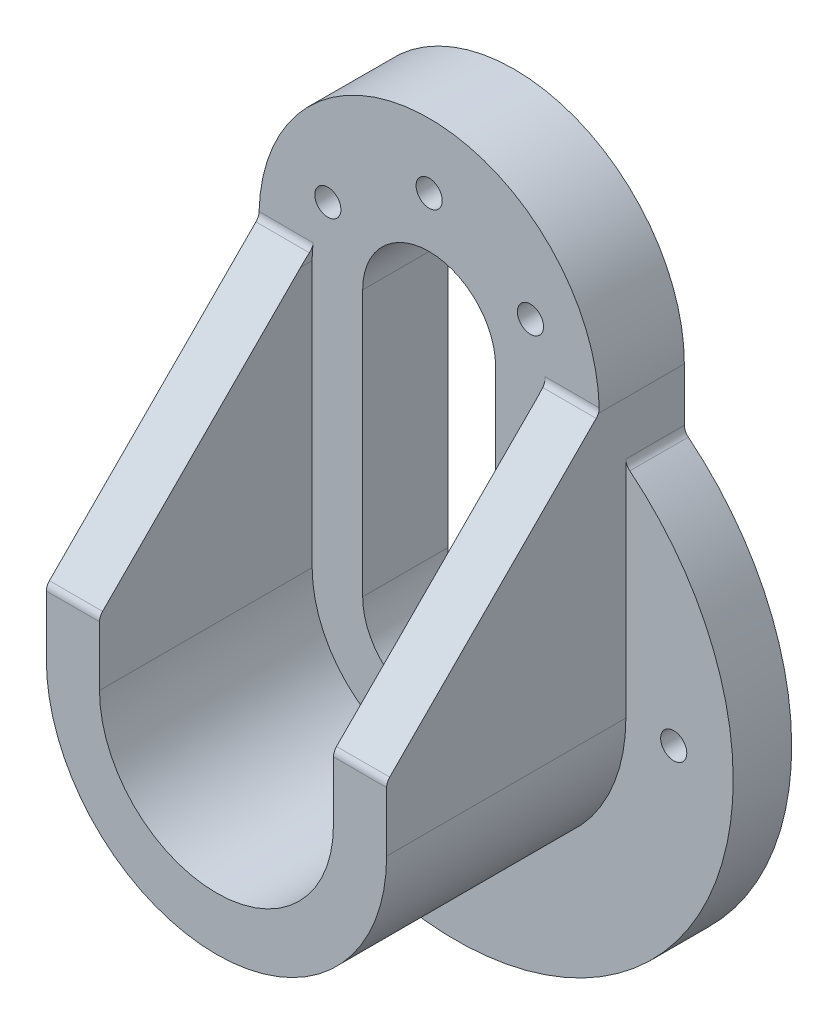
ISO-10303-21;
HEADER;
FILE_DESCRIPTION(('STEP AP214'),'2;1');
FILE_NAME('part.step','',(''),(''),'','','');
FILE_SCHEMA(('AUTOMOTIVE_DESIGN { 1 0 10303 214 1 1 1 1 }'));
ENDSEC;
DATA;
#1=APPLICATION_CONTEXT('core data for automotive mechanical design processes');
#2=APPLICATION_PROTOCOL_DEFINITION('international standard','automotive_design',2000,#1);
#3=PRODUCT_CONTEXT('',#1,'mechanical');
#4=PRODUCT('Part','Part','',(#3));
#5=PRODUCT_RELATED_PRODUCT_CATEGORY('part','',(#4));
#6=PRODUCT_DEFINITION_FORMATION('','',#4);
#7=PRODUCT_DEFINITION_CONTEXT('part definition',#1,'design');
#8=PRODUCT_DEFINITION('design','',#6,#7);
#9=PRODUCT_DEFINITION_SHAPE('','',#8);
#10=(LENGTH_UNIT() NAMED_UNIT(*) SI_UNIT(.MILLI.,.METRE.));
#11=(NAMED_UNIT(*) PLANE_ANGLE_UNIT() SI_UNIT($,.RADIAN.));
#12=(NAMED_UNIT(*) SI_UNIT($,.STERADIAN.) SOLID_ANGLE_UNIT());
#13=UNCERTAINTY_MEASURE_WITH_UNIT(LENGTH_MEASURE(1.E-05),#10,'distance_accuracy_value','');
#14=(GEOMETRIC_REPRESENTATION_CONTEXT(3) GLOBAL_UNCERTAINTY_ASSIGNED_CONTEXT((#13)) GLOBAL_UNIT_ASSIGNED_CONTEXT((#10,
#11,#12)) REPRESENTATION_CONTEXT('',''));
#15=CARTESIAN_POINT('',(0.,0.,0.));
#16=DIRECTION('',(0.,0.,1.));
#17=DIRECTION('',(1.,0.,0.));
#18=AXIS2_PLACEMENT_3D('',#15,#16,#17);
#19=CARTESIAN_POINT('',(0.,0.,-16.));
#20=DIRECTION('',(0.,0.,1.));
#21=DIRECTION('',(1.,0.,0.));
#22=AXIS2_PLACEMENT_3D('',#19,#20,#21);
#23=PLANE('',#22);
#24=CARTESIAN_POINT('',(-41.,0.,-16.));
#25=DIRECTION('',(0.,0.,-1.));
#26=DIRECTION('',(-1.,0.,0.));
#27=AXIS2_PLACEMENT_3D('',#24,#25,#26);
#28=CIRCLE('',#27,2.45744999999999);
#29=CARTESIAN_POINT('',(-43.45745,0.,-16.));
#30=VERTEX_POINT('',#29);
#31=EDGE_CURVE('E329',#30,#30,#28,.T.);
#32=ORIENTED_EDGE('',*,*,#31,.F.);
#33=EDGE_LOOP('',(#32));
#34=FACE_BOUND('',#33,.T.);
#35=CARTESIAN_POINT('',(-19.0525588832576,61.0000000000001,-16.));
#36=DIRECTION('',(0.,0.,1.));
#37=DIRECTION('',(1.,0.,0.));
#38=AXIS2_PLACEMENT_3D('',#35,#36,#37);
#39=CIRCLE('',#38,2.45745);
#40=CARTESIAN_POINT('',(-16.5951088832576,61.0000000000001,-16.));
#41=VERTEX_POINT('',#40);
#42=EDGE_CURVE('E534',#41,#41,#39,.T.);
#43=ORIENTED_EDGE('',*,*,#42,.T.);
#44=EDGE_LOOP('',(#43));
#45=FACE_BOUND('',#44,.T.);
#46=CARTESIAN_POINT('',(19.0525588832576,61.,-16.));
#47=DIRECTION('',(0.,0.,1.));
#48=DIRECTION('',(1.,0.,0.));
#49=AXIS2_PLACEMENT_3D('',#46,#47,#48);
#50=CIRCLE('',#49,2.45745);
#51=CARTESIAN_POINT('',(21.5100088832576,61.,-16.));
#52=VERTEX_POINT('',#51);
#53=EDGE_CURVE('E528',#52,#52,#50,.T.);
#54=ORIENTED_EDGE('',*,*,#53,.T.);
#55=EDGE_LOOP('',(#54));
#56=FACE_BOUND('',#55,.T.);
#57=CARTESIAN_POINT('',(0.,72.,-16.));
#58=DIRECTION('',(0.,0.,1.));
#59=DIRECTION('',(1.,0.,0.));
#60=AXIS2_PLACEMENT_3D('',#57,#58,#59);
#61=CIRCLE('',#60,2.45745);
#62=CARTESIAN_POINT('',(2.45745,72.,-16.));
#63=VERTEX_POINT('',#62);
#64=EDGE_CURVE('E519',#63,#63,#61,.T.);
#65=ORIENTED_EDGE('',*,*,#64,.T.);
#66=EDGE_LOOP('',(#65));
#67=FACE_BOUND('',#66,.T.);
#68=DIRECTION('',(0.,-1.,0.));
#69=VECTOR('',#68,1.);
#70=CARTESIAN_POINT('',(-12.5,0.,-16.));
#71=LINE('',#70,#69);
#72=CARTESIAN_POINT('',(-12.5,50.,-16.));
#73=VERTEX_POINT('',#72);
#74=CARTESIAN_POINT('',(-12.5,0.,-16.));
#75=VERTEX_POINT('',#74);
#76=EDGE_CURVE('E246',#73,#75,#71,.T.);
#77=ORIENTED_EDGE('',*,*,#76,.T.);
#78=CARTESIAN_POINT('',(0.,0.,-16.));
#79=DIRECTION('',(0.,0.,1.));
#80=DIRECTION('',(1.,0.,0.));
#81=AXIS2_PLACEMENT_3D('',#78,#79,#80);
#82=CIRCLE('',#81,12.5);
#83=CARTESIAN_POINT('',(12.5,0.,-16.));
#84=VERTEX_POINT('',#83);
#85=EDGE_CURVE('E237',#75,#84,#82,.T.);
#86=ORIENTED_EDGE('',*,*,#85,.T.);
#87=DIRECTION('',(0.,1.,0.));
#88=VECTOR('',#87,1.);
#89=CARTESIAN_POINT('',(12.5,0.,-16.));
#90=LINE('',#89,#88);
#91=CARTESIAN_POINT('',(12.5,50.,-16.));
#92=VERTEX_POINT('',#91);
#93=EDGE_CURVE('E240',#84,#92,#90,.T.);
#94=ORIENTED_EDGE('',*,*,#93,.T.);
#95=CARTESIAN_POINT('',(0.,50.,-16.));
#96=DIRECTION('',(0.,0.,1.));
#97=DIRECTION('',(1.,0.,0.));
#98=AXIS2_PLACEMENT_3D('',#95,#96,#97);
#99=CIRCLE('',#98,12.5);
#100=EDGE_CURVE('E243',#92,#73,#99,.T.);
#101=ORIENTED_EDGE('',*,*,#100,.T.);
#102=EDGE_LOOP('',(#77,#86,#94,#101));
#103=FACE_BOUND('',#102,.T.);
#104=DIRECTION('',(0.,1.,0.));
#105=VECTOR('',#104,1.);
#106=CARTESIAN_POINT('',(32.,0.,-16.));
#107=LINE('',#106,#105);
#108=CARTESIAN_POINT('',(32.,42.193858725362,-16.));
#109=VERTEX_POINT('',#108);
#110=CARTESIAN_POINT('',(32.,52.1878373266161,-16.));
#111=VERTEX_POINT('',#110);
#112=EDGE_CURVE('E270',#109,#111,#107,.T.);
#113=ORIENTED_EDGE('',*,*,#112,.F.);
#114=CARTESIAN_POINT('',(34.,42.193858725362,-16.));
#115=DIRECTION('',(0.,0.,1.));
#116=DIRECTION('',(1.,0.,0.));
#117=AXIS2_PLACEMENT_3D('',#114,#115,#116);
#118=CIRCLE('',#117,2.);
#119=CARTESIAN_POINT('',(32.7451058511501,40.6365403008956,-16.));
#120=VERTEX_POINT('',#119);
#121=EDGE_CURVE('E43',#109,#120,#118,.T.);
#122=ORIENTED_EDGE('',*,*,#121,.T.);
#123=CARTESIAN_POINT('',(0.,0.,-16.));
#124=DIRECTION('',(0.,0.,1.));
#125=DIRECTION('',(1.,0.,0.));
#126=AXIS2_PLACEMENT_3D('',#123,#124,#125);
#127=CIRCLE('',#126,52.1878373266161);
#128=CARTESIAN_POINT('',(-32.7451058511501,40.6365403008956,-16.));
#129=VERTEX_POINT('',#128);
#130=EDGE_CURVE('E262',#129,#120,#127,.T.);
#131=ORIENTED_EDGE('',*,*,#130,.F.);
#132=CARTESIAN_POINT('',(-34.,42.193858725362,-16.));
#133=DIRECTION('',(0.,0.,1.));
#134=DIRECTION('',(1.,0.,0.));
#135=AXIS2_PLACEMENT_3D('',#132,#133,#134);
#136=CIRCLE('',#135,2.);
#137=CARTESIAN_POINT('',(-32.,42.193858725362,-16.));
#138=VERTEX_POINT('',#137);
#139=EDGE_CURVE('E447',#129,#138,#136,.T.);
#140=ORIENTED_EDGE('',*,*,#139,.T.);
#141=DIRECTION('',(0.,1.,0.));
#142=VECTOR('',#141,1.);
#143=CARTESIAN_POINT('',(-32.,0.,-16.));
#144=LINE('',#143,#142);
#145=CARTESIAN_POINT('',(-32.,52.1878373266161,-16.));
#146=VERTEX_POINT('',#145);
#147=EDGE_CURVE('E275',#138,#146,#144,.T.);
#148=ORIENTED_EDGE('',*,*,#147,.T.);
#149=CARTESIAN_POINT('',(0.,52.1878373266161,-16.));
#150=DIRECTION('',(0.,0.,1.));
#151=DIRECTION('',(1.,0.,0.));
#152=AXIS2_PLACEMENT_3D('',#149,#150,#151);
#153=CIRCLE('',#152,32.);
#154=EDGE_CURVE('E272',#111,#146,#153,.T.);
#155=ORIENTED_EDGE('',*,*,#154,.F.);
#156=EDGE_LOOP('',(#113,#122,#131,#140,#148,#155));
#157=FACE_BOUND('',#156,.T.);
#158=CARTESIAN_POINT('',(41.,0.,-16.));
#159=DIRECTION('',(0.,0.,-1.));
#160=DIRECTION('',(-1.,0.,0.));
#161=AXIS2_PLACEMENT_3D('',#158,#159,#160);
#162=CIRCLE('',#161,2.45744999999999);
#163=CARTESIAN_POINT('',(38.54255,0.,-16.));
#164=VERTEX_POINT('',#163);
#165=EDGE_CURVE('E325',#164,#164,#162,.T.);
#166=ORIENTED_EDGE('',*,*,#165,.F.);
#167=EDGE_LOOP('',(#166));
#168=FACE_BOUND('',#167,.T.);
#169=CARTESIAN_POINT('',(0.,-41.,-16.));
#170=DIRECTION('',(0.,0.,-1.));
#171=DIRECTION('',(-1.,0.,0.));
#172=AXIS2_PLACEMENT_3D('',#169,#170,#171);
#173=CIRCLE('',#172,2.45744999999999);
#174=CARTESIAN_POINT('',(-2.45744999999999,-41.,-16.));
#175=VERTEX_POINT('',#174);
#176=EDGE_CURVE('E330',#175,#175,#173,.T.);
#177=ORIENTED_EDGE('',*,*,#176,.F.);
#178=EDGE_LOOP('',(#177));
#179=FACE_BOUND('',#178,.T.);
#180=ADVANCED_FACE('F35',(#34,#45,#56,#67,#103,#157,#168,#179),#23,.F.);
#181=CARTESIAN_POINT('',(0.,50.,0.));
#182=DIRECTION('',(0.,0.,1.));
#183=DIRECTION('',(1.,0.,0.));
#184=AXIS2_PLACEMENT_3D('',#181,#182,#183);
#185=CYLINDRICAL_SURFACE('',#184,22.);
#186=DIRECTION('',(0.,0.,1.));
#187=VECTOR('',#186,1.);
#188=CARTESIAN_POINT('',(22.,50.,0.));
#189=LINE('',#188,#187);
#190=CARTESIAN_POINT('',(22.,50.,0.));
#191=VERTEX_POINT('',#190);
#192=CARTESIAN_POINT('',(22.,50.,2.17761140897928));
#193=VERTEX_POINT('',#192);
#194=EDGE_CURVE('E220',#191,#193,#189,.T.);
#195=ORIENTED_EDGE('',*,*,#194,.T.);
#196=CARTESIAN_POINT('',(0.,50.,2.17761140897929));
#197=DIRECTION('',(0.,-0.705448471756706,-0.70876121063171));
#198=DIRECTION('',(0.,-0.70876121063171,0.705448471756706));
#199=AXIS2_PLACEMENT_3D('',#196,#197,#198);
#200=ELLIPSE('',#199,31.0400733984746,22.);
#201=CARTESIAN_POINT('',(21.9415495077587,51.6026244720994,0.582477578736564));
#202=VERTEX_POINT('',#201);
#203=EDGE_CURVE('E206',#193,#202,#200,.F.);
#204=ORIENTED_EDGE('',*,*,#203,.T.);
#205=CARTESIAN_POINT('',(21.9415495077587,51.6026244720994,0.582477578736581));
#206=CARTESIAN_POINT('',(21.9386403688496,51.6424531020536,0.542835848804801));
#207=CARTESIAN_POINT('',(21.9355020785693,51.6839247776312,0.504901144272656));
#208=CARTESIAN_POINT('',(21.9287339390922,51.7698845092516,0.432670223736206));
#209=CARTESIAN_POINT('',(21.9251041047282,51.8143724742544,0.398373897995576));
#210=CARTESIAN_POINT('',(21.9134315652484,51.951907670187,0.301312631195397));
#211=CARTESIAN_POINT('',(21.9046025785488,52.0490722840365,0.244329639346155));
#212=CARTESIAN_POINT('',(21.8847360056665,52.2513726203151,0.147504672207877));
#213=CARTESIAN_POINT('',(21.873697122173,52.3565130022624,0.107672808899073));
#214=CARTESIAN_POINT('',(21.8494486585541,52.5716228820764,0.0462377916142625));
#215=CARTESIAN_POINT('',(21.8362431988387,52.6815829284529,0.0246005044872213));
#216=CARTESIAN_POINT('',(21.8173707897701,52.8290856105941,0.00817637818528167));
#217=CARTESIAN_POINT('',(21.8125587418083,52.8659507637769,0.00510811691843141));
#218=CARTESIAN_POINT('',(21.8027392904783,52.9397169475892,0.00102244721047741));
#219=CARTESIAN_POINT('',(21.7977321648536,52.9766178591679,2.22433321546773E-06));
#220=CARTESIAN_POINT('',(21.7926292281965,53.0135214156128,0.));
#221=B_SPLINE_CURVE_WITH_KNOTS('',3,(#205,#206,#207,#208,#209,#210,#211,#212,#213,#214,#215,
#216,#217,#218,#219,#220),.UNSPECIFIED.,.F.,.F.,(4,2,2,2,2,2,2,4),(0.,0.168702836620993,
0.337400583586161,0.674603490869276,1.01200493527835,1.34877199108211,1.46064422207649,
1.57236261152918),.UNSPECIFIED.);
#222=CARTESIAN_POINT('',(21.7926292281965,53.0135214156128,0.));
#223=VERTEX_POINT('',#222);
#224=EDGE_CURVE('E366',#202,#223,#221,.T.);
#225=ORIENTED_EDGE('',*,*,#224,.T.);
#226=CARTESIAN_POINT('',(0.,50.,0.));
#227=DIRECTION('',(0.,0.,1.));
#228=DIRECTION('',(1.,0.,0.));
#229=AXIS2_PLACEMENT_3D('',#226,#227,#228);
#230=CIRCLE('',#229,22.);
#231=EDGE_CURVE('E494',#191,#223,#230,.T.);
#232=ORIENTED_EDGE('',*,*,#231,.F.);
#233=EDGE_LOOP('',(#195,#204,#225,#232));
#234=FACE_BOUND('',#233,.T.);
#235=ADVANCED_FACE('F382',(#234),#185,.F.);
#236=CARTESIAN_POINT('',(0.,0.,-16.));
#237=DIRECTION('',(0.,0.,1.));
#238=DIRECTION('',(1.,0.,0.));
#239=AXIS2_PLACEMENT_3D('',#236,#237,#238);
#240=CYLINDRICAL_SURFACE('',#239,12.5);
#241=CARTESIAN_POINT('',(0.,0.,0.));
#242=DIRECTION('',(0.,0.,1.));
#243=DIRECTION('',(1.,0.,0.));
#244=AXIS2_PLACEMENT_3D('',#241,#242,#243);
#245=CIRCLE('',#244,12.5);
#246=CARTESIAN_POINT('',(12.5,0.,0.));
#247=VERTEX_POINT('',#246);
#248=CARTESIAN_POINT('',(-12.5,0.,0.));
#249=VERTEX_POINT('',#248);
#250=EDGE_CURVE('E235',#247,#249,#245,.F.);
#251=ORIENTED_EDGE('',*,*,#250,.F.);
#252=DIRECTION('',(0.,0.,1.));
#253=VECTOR('',#252,1.);
#254=CARTESIAN_POINT('',(12.5,0.,-16.));
#255=LINE('',#254,#253);
#256=EDGE_CURVE('E249',#84,#247,#255,.T.);
#257=ORIENTED_EDGE('',*,*,#256,.F.);
#258=ORIENTED_EDGE('',*,*,#85,.F.);
#259=DIRECTION('',(0.,0.,1.));
#260=VECTOR('',#259,1.);
#261=CARTESIAN_POINT('',(-12.5,0.,-16.));
#262=LINE('',#261,#260);
#263=EDGE_CURVE('E250',#75,#249,#262,.T.);
#264=ORIENTED_EDGE('',*,*,#263,.T.);
#265=EDGE_LOOP('',(#251,#257,#258,#264));
#266=FACE_BOUND('',#265,.T.);
#267=ADVANCED_FACE('F397',(#266),#240,.F.);
#268=CARTESIAN_POINT('',(-12.5,0.,-16.));
#269=DIRECTION('',(-1.,0.,0.));
#270=DIRECTION('',(0.,0.,1.));
#271=AXIS2_PLACEMENT_3D('',#268,#269,#270);
#272=PLANE('',#271);
#273=DIRECTION('',(0.,1.,0.));
#274=VECTOR('',#273,1.);
#275=CARTESIAN_POINT('',(-12.5,0.,0.));
#276=LINE('',#275,#274);
#277=CARTESIAN_POINT('',(-12.5,50.,0.));
#278=VERTEX_POINT('',#277);
#279=EDGE_CURVE('E233',#249,#278,#276,.T.);
#280=ORIENTED_EDGE('',*,*,#279,.F.);
#281=ORIENTED_EDGE('',*,*,#263,.F.);
#282=ORIENTED_EDGE('',*,*,#76,.F.);
#283=DIRECTION('',(0.,0.,1.));
#284=VECTOR('',#283,1.);
#285=CARTESIAN_POINT('',(-12.5,50.,-16.));
#286=LINE('',#285,#284);
#287=EDGE_CURVE('E254',#73,#278,#286,.T.);
#288=ORIENTED_EDGE('',*,*,#287,.T.);
#289=EDGE_LOOP('',(#280,#281,#282,#288));
#290=FACE_BOUND('',#289,.T.);
#291=ADVANCED_FACE('F393',(#290),#272,.F.);
#292=CARTESIAN_POINT('',(0.,50.,-16.));
#293=DIRECTION('',(0.,0.,1.));
#294=DIRECTION('',(1.,0.,0.));
#295=AXIS2_PLACEMENT_3D('',#292,#293,#294);
#296=CYLINDRICAL_SURFACE('',#295,12.5);
#297=CARTESIAN_POINT('',(0.,50.,0.));
#298=DIRECTION('',(0.,0.,1.));
#299=DIRECTION('',(1.,0.,0.));
#300=AXIS2_PLACEMENT_3D('',#297,#298,#299);
#301=CIRCLE('',#300,12.5);
#302=CARTESIAN_POINT('',(12.5,50.,0.));
#303=VERTEX_POINT('',#302);
#304=EDGE_CURVE('E223',#278,#303,#301,.F.);
#305=ORIENTED_EDGE('',*,*,#304,.F.);
#306=ORIENTED_EDGE('',*,*,#287,.F.);
#307=ORIENTED_EDGE('',*,*,#100,.F.);
#308=DIRECTION('',(0.,0.,1.));
#309=VECTOR('',#308,1.);
#310=CARTESIAN_POINT('',(12.5,50.,-16.));
#311=LINE('',#310,#309);
#312=EDGE_CURVE('E257',#92,#303,#311,.T.);
#313=ORIENTED_EDGE('',*,*,#312,.T.);
#314=EDGE_LOOP('',(#305,#306,#307,#313));
#315=FACE_BOUND('',#314,.T.);
#316=ADVANCED_FACE('F396',(#315),#296,.F.);
#317=CARTESIAN_POINT('',(12.5,0.,-16.));
#318=DIRECTION('',(1.,0.,0.));
#319=DIRECTION('',(0.,0.,-1.));
#320=AXIS2_PLACEMENT_3D('',#317,#318,#319);
#321=PLANE('',#320);
#322=DIRECTION('',(0.,-1.,0.));
#323=VECTOR('',#322,1.);
#324=CARTESIAN_POINT('',(12.5,0.,0.));
#325=LINE('',#324,#323);
#326=EDGE_CURVE('E299',#303,#247,#325,.T.);
#327=ORIENTED_EDGE('',*,*,#326,.F.);
#328=ORIENTED_EDGE('',*,*,#312,.F.);
#329=ORIENTED_EDGE('',*,*,#93,.F.);
#330=ORIENTED_EDGE('',*,*,#256,.T.);
#331=EDGE_LOOP('',(#327,#328,#329,#330));
#332=FACE_BOUND('',#331,.T.);
#333=ADVANCED_FACE('F401',(#332),#321,.F.);
#334=CARTESIAN_POINT('',(32.,0.,40.));
#335=DIRECTION('',(-1.,0.,0.));
#336=DIRECTION('',(0.,0.,1.));
#337=AXIS2_PLACEMENT_3D('',#334,#335,#336);
#338=PLANE('',#337);
#339=DIRECTION('',(0.,1.,0.));
#340=VECTOR('',#339,1.);
#341=CARTESIAN_POINT('',(32.,0.,-5.));
#342=LINE('',#341,#340);
#343=CARTESIAN_POINT('',(32.,0.,-5.));
#344=VERTEX_POINT('',#343);
#345=CARTESIAN_POINT('',(32.,42.193858725362,-5.));
#346=VERTEX_POINT('',#345);
#347=EDGE_CURVE('E50',#344,#346,#342,.T.);
#348=ORIENTED_EDGE('',*,*,#347,.T.);
#349=DIRECTION('',(0.,0.,1.));
#350=VECTOR('',#349,1.);
#351=CARTESIAN_POINT('',(32.,42.193858725362,40.));
#352=LINE('',#351,#350);
#353=EDGE_CURVE('E450',#346,#109,#352,.F.);
#354=ORIENTED_EDGE('',*,*,#353,.T.);
#355=ORIENTED_EDGE('',*,*,#112,.T.);
#356=DIRECTION('',(0.,0.,-1.));
#357=VECTOR('',#356,1.);
#358=CARTESIAN_POINT('',(32.,52.1878373266161,40.));
#359=LINE('',#358,#357);
#360=CARTESIAN_POINT('',(32.,52.1878373266161,0.178394723004564));
#361=VERTEX_POINT('',#360);
#362=EDGE_CURVE('E293',#361,#111,#359,.T.);
#363=ORIENTED_EDGE('',*,*,#362,.F.);
#364=CARTESIAN_POINT('',(32.,53.0135214156128,2.));
#365=DIRECTION('',(-1.,0.,0.));
#366=DIRECTION('',(0.,0.,1.));
#367=AXIS2_PLACEMENT_3D('',#364,#365,#366);
#368=CIRCLE('',#367,2.);
#369=CARTESIAN_POINT('',(32.,51.6026244720994,0.582477578736581));
#370=VERTEX_POINT('',#369);
#371=EDGE_CURVE('E348',#361,#370,#368,.T.);
#372=ORIENTED_EDGE('',*,*,#371,.T.);
#373=DIRECTION('',(0.,0.70876121063171,-0.705448471756706));
#374=VECTOR('',#373,1.);
#375=CARTESIAN_POINT('',(32.,52.1878373266161,0.));
#376=LINE('',#375,#374);
#377=CARTESIAN_POINT('',(32.,12.5852128545167,39.4175224212634));
#378=VERTEX_POINT('',#377);
#379=EDGE_CURVE('E514',#378,#370,#376,.T.);
#380=ORIENTED_EDGE('',*,*,#379,.F.);
#381=CARTESIAN_POINT('',(32.,11.1743159110033,38.));
#382=DIRECTION('',(-1.,0.,0.));
#383=DIRECTION('',(0.,0.,1.));
#384=AXIS2_PLACEMENT_3D('',#381,#382,#383);
#385=CIRCLE('',#384,2.);
#386=CARTESIAN_POINT('',(32.,11.1743159110033,40.));
#387=VERTEX_POINT('',#386);
#388=EDGE_CURVE('E306',#378,#387,#385,.F.);
#389=ORIENTED_EDGE('',*,*,#388,.T.);
#390=DIRECTION('',(0.,1.,0.));
#391=VECTOR('',#390,1.);
#392=CARTESIAN_POINT('',(32.,0.,40.));
#393=LINE('',#392,#391);
#394=CARTESIAN_POINT('',(32.,0.,40.));
#395=VERTEX_POINT('',#394);
#396=EDGE_CURVE('E277',#395,#387,#393,.T.);
#397=ORIENTED_EDGE('',*,*,#396,.F.);
#398=DIRECTION('',(0.,0.,-1.));
#399=VECTOR('',#398,1.);
#400=CARTESIAN_POINT('',(32.,0.,40.));
#401=LINE('',#400,#399);
#402=EDGE_CURVE('E285',#395,#344,#401,.T.);
#403=ORIENTED_EDGE('',*,*,#402,.T.);
#404=EDGE_LOOP('',(#348,#354,#355,#363,#372,#380,#389,#397,#403));
#405=FACE_BOUND('',#404,.T.);
#406=ADVANCED_FACE('F405',(#405),#338,.F.);
#407=CARTESIAN_POINT('',(0.,52.1878373266161,40.));
#408=DIRECTION('',(0.,0.,-1.));
#409=DIRECTION('',(-1.,0.,0.));
#410=AXIS2_PLACEMENT_3D('',#407,#408,#409);
#411=CYLINDRICAL_SURFACE('',#410,32.);
#412=DIRECTION('',(0.,0.,-1.));
#413=VECTOR('',#412,1.);
#414=CARTESIAN_POINT('',(-32.,52.1878373266161,40.));
#415=LINE('',#414,#413);
#416=CARTESIAN_POINT('',(-32.,52.1878373266161,0.178394723004564));
#417=VERTEX_POINT('',#416);
#418=EDGE_CURVE('E290',#417,#146,#415,.T.);
#419=ORIENTED_EDGE('',*,*,#418,.F.);
#420=CARTESIAN_POINT('',(-32.,52.1878373266161,0.178394723004563));
#421=CARTESIAN_POINT('',(-32.0000012988931,52.239414879399,0.155008894667187));
#422=CARTESIAN_POINT('',(-31.9998753821367,52.2919902326153,0.133825589601059));
#423=CARTESIAN_POINT('',(-31.999349062357,52.3987566278793,0.0959870044649456));
#424=CARTESIAN_POINT('',(-31.9989486039162,52.4529479940133,0.079332639529022));
#425=CARTESIAN_POINT('',(-31.9978627591802,52.561581913256,0.0509362992831871));
#426=CARTESIAN_POINT('',(-31.9971825061449,52.6160032989629,0.039113104588344));
#427=CARTESIAN_POINT('',(-31.9955275820384,52.7256193735883,0.0200495214606834));
#428=CARTESIAN_POINT('',(-31.9945530088057,52.7808137997258,0.0128076125799549));
#429=CARTESIAN_POINT('',(-31.9922365194126,52.8951615636295,0.00262651067096588));
#430=CARTESIAN_POINT('',(-31.9908750577133,52.954341843145,-7.05372248977936E-06));
#431=CARTESIAN_POINT('',(-31.9893458167743,53.0135214156128,0.));
#432=B_SPLINE_CURVE_WITH_KNOTS('',3,(#420,#421,#422,#423,#424,#425,#426,#427,#428,#429,#430,
#431),.UNSPECIFIED.,.F.,.F.,(4,2,2,2,2,4),(0.,0.169842910299552,0.339720114215354,
0.506610613307957,0.673445695291009,0.850977104070458),.UNSPECIFIED.);
#433=CARTESIAN_POINT('',(-31.9893458167743,53.0135214156128,0.));
#434=VERTEX_POINT('',#433);
#435=EDGE_CURVE('E464',#417,#434,#432,.T.);
#436=ORIENTED_EDGE('',*,*,#435,.T.);
#437=CARTESIAN_POINT('',(0.,52.1878373266161,0.));
#438=DIRECTION('',(0.,0.,-1.));
#439=DIRECTION('',(-1.,0.,0.));
#440=AXIS2_PLACEMENT_3D('',#437,#438,#439);
#441=CIRCLE('',#440,32.);
#442=CARTESIAN_POINT('',(31.9893458167743,53.0135214156128,0.));
#443=VERTEX_POINT('',#442);
#444=EDGE_CURVE('E477',#434,#443,#441,.T.);
#445=ORIENTED_EDGE('',*,*,#444,.T.);
#446=CARTESIAN_POINT('',(31.9893458167743,53.0135214156128,0.));
#447=CARTESIAN_POINT('',(31.9908086302432,52.9569086894987,-6.50181150794348E-06));
#448=CARTESIAN_POINT('',(31.992118076294,52.9002924878563,0.00240341217393403));
#449=CARTESIAN_POINT('',(31.9944311171524,52.787450114788,0.01201314846117));
#450=CARTESIAN_POINT('',(31.9954346502064,52.7312240243478,0.0192139369444433));
#451=CARTESIAN_POINT('',(31.9971212015394,52.6205634364177,0.0381941374836962));
#452=CARTESIAN_POINT('',(31.9978095447156,52.5661148200141,0.0498908251818322));
#453=CARTESIAN_POINT('',(31.9989013760483,52.4583982797745,0.0777798836253736));
#454=CARTESIAN_POINT('',(31.9993049587011,52.4051299699493,0.093970760511637));
#455=CARTESIAN_POINT('',(31.9998637847203,52.2967568842851,0.131910106010477));
#456=CARTESIAN_POINT('',(32.0000014473886,52.2417533253237,0.153948336329133));
#457=CARTESIAN_POINT('',(32.,52.1878373266161,0.178394723004562));
#458=B_SPLINE_CURVE_WITH_KNOTS('',3,(#446,#447,#448,#449,#450,#451,#452,#453,#454,#455,#456,
#457),.UNSPECIFIED.,.F.,.F.,(4,2,2,2,2,4),(0.,0.169842919388186,0.339720101590902,
0.506610607172158,0.673445704990136,0.850977103880419),.UNSPECIFIED.);
#459=EDGE_CURVE('E340',#443,#361,#458,.T.);
#460=ORIENTED_EDGE('',*,*,#459,.T.);
#461=ORIENTED_EDGE('',*,*,#362,.T.);
#462=ORIENTED_EDGE('',*,*,#154,.T.);
#463=EDGE_LOOP('',(#419,#436,#445,#460,#461,#462));
#464=FACE_BOUND('',#463,.T.);
#465=ADVANCED_FACE('F350',(#464),#411,.T.);
#466=CARTESIAN_POINT('',(-32.,0.,40.));
#467=DIRECTION('',(-1.,0.,0.));
#468=DIRECTION('',(0.,0.,1.));
#469=AXIS2_PLACEMENT_3D('',#466,#467,#468);
#470=PLANE('',#469);
#471=ORIENTED_EDGE('',*,*,#147,.F.);
#472=DIRECTION('',(0.,0.,-1.));
#473=VECTOR('',#472,1.);
#474=CARTESIAN_POINT('',(-32.,42.193858725362,-5.));
#475=LINE('',#474,#473);
#476=CARTESIAN_POINT('',(-32.,42.193858725362,-5.));
#477=VERTEX_POINT('',#476);
#478=EDGE_CURVE('E439',#138,#477,#475,.F.);
#479=ORIENTED_EDGE('',*,*,#478,.T.);
#480=DIRECTION('',(0.,1.,0.));
#481=VECTOR('',#480,1.);
#482=CARTESIAN_POINT('',(-32.,0.,-5.));
#483=LINE('',#482,#481);
#484=CARTESIAN_POINT('',(-32.,0.,-5.));
#485=VERTEX_POINT('',#484);
#486=EDGE_CURVE('E265',#485,#477,#483,.T.);
#487=ORIENTED_EDGE('',*,*,#486,.F.);
#488=DIRECTION('',(0.,0.,-1.));
#489=VECTOR('',#488,1.);
#490=CARTESIAN_POINT('',(-32.,0.,40.));
#491=LINE('',#490,#489);
#492=CARTESIAN_POINT('',(-32.,0.,40.));
#493=VERTEX_POINT('',#492);
#494=EDGE_CURVE('E287',#493,#485,#491,.T.);
#495=ORIENTED_EDGE('',*,*,#494,.F.);
#496=DIRECTION('',(0.,1.,0.));
#497=VECTOR('',#496,1.);
#498=CARTESIAN_POINT('',(-32.,0.,40.));
#499=LINE('',#498,#497);
#500=CARTESIAN_POINT('',(-32.,11.1743159110033,40.));
#501=VERTEX_POINT('',#500);
#502=EDGE_CURVE('E280',#493,#501,#499,.T.);
#503=ORIENTED_EDGE('',*,*,#502,.T.);
#504=CARTESIAN_POINT('',(-32.,11.1743159110033,38.));
#505=DIRECTION('',(-1.,0.,0.));
#506=DIRECTION('',(0.,0.,1.));
#507=AXIS2_PLACEMENT_3D('',#504,#505,#506);
#508=CIRCLE('',#507,2.);
#509=CARTESIAN_POINT('',(-32.,12.5852128545167,39.4175224212634));
#510=VERTEX_POINT('',#509);
#511=EDGE_CURVE('E317',#501,#510,#508,.T.);
#512=ORIENTED_EDGE('',*,*,#511,.T.);
#513=DIRECTION('',(0.,-0.70876121063171,0.705448471756706));
#514=VECTOR('',#513,1.);
#515=CARTESIAN_POINT('',(-32.,5.97189055564647,45.9999341545669));
#516=LINE('',#515,#514);
#517=CARTESIAN_POINT('',(-32.,51.6026244720994,0.582477578736563));
#518=VERTEX_POINT('',#517);
#519=EDGE_CURVE('E214',#518,#510,#516,.T.);
#520=ORIENTED_EDGE('',*,*,#519,.F.);
#521=CARTESIAN_POINT('',(-32.,53.0135214156128,2.));
#522=DIRECTION('',(-1.,0.,0.));
#523=DIRECTION('',(0.,0.,1.));
#524=AXIS2_PLACEMENT_3D('',#521,#522,#523);
#525=CIRCLE('',#524,2.);
#526=EDGE_CURVE('E465',#518,#417,#525,.F.);
#527=ORIENTED_EDGE('',*,*,#526,.T.);
#528=ORIENTED_EDGE('',*,*,#418,.T.);
#529=EDGE_LOOP('',(#471,#479,#487,#495,#503,#512,#520,#527,#528));
#530=FACE_BOUND('',#529,.T.);
#531=ADVANCED_FACE('F427',(#530),#470,.T.);
#532=CARTESIAN_POINT('',(0.,0.,40.));
#533=DIRECTION('',(0.,0.,-1.));
#534=DIRECTION('',(-1.,0.,0.));
#535=AXIS2_PLACEMENT_3D('',#532,#533,#534);
#536=CYLINDRICAL_SURFACE('',#535,32.);
#537=ORIENTED_EDGE('',*,*,#494,.T.);
#538=CARTESIAN_POINT('',(0.,0.,-5.));
#539=DIRECTION('',(0.,0.,1.));
#540=DIRECTION('',(1.,0.,0.));
#541=AXIS2_PLACEMENT_3D('',#538,#539,#540);
#542=CIRCLE('',#541,32.);
#543=EDGE_CURVE('E296',#485,#344,#542,.T.);
#544=ORIENTED_EDGE('',*,*,#543,.T.);
#545=ORIENTED_EDGE('',*,*,#402,.F.);
#546=CARTESIAN_POINT('',(0.,0.,40.));
#547=DIRECTION('',(0.,0.,1.));
#548=DIRECTION('',(1.,0.,0.));
#549=AXIS2_PLACEMENT_3D('',#546,#547,#548);
#550=CIRCLE('',#549,32.);
#551=EDGE_CURVE('E283',#493,#395,#550,.T.);
#552=ORIENTED_EDGE('',*,*,#551,.F.);
#553=EDGE_LOOP('',(#537,#544,#545,#552));
#554=FACE_BOUND('',#553,.T.);
#555=ADVANCED_FACE('F424',(#554),#536,.T.);
#556=CARTESIAN_POINT('',(0.,0.,40.));
#557=DIRECTION('',(0.,0.,1.));
#558=DIRECTION('',(1.,0.,0.));
#559=AXIS2_PLACEMENT_3D('',#556,#557,#558);
#560=PLANE('',#559);
#561=ORIENTED_EDGE('',*,*,#396,.T.);
#562=DIRECTION('',(1.,0.,0.));
#563=VECTOR('',#562,1.);
#564=CARTESIAN_POINT('',(22.,11.1743159110033,40.));
#565=LINE('',#564,#563);
#566=CARTESIAN_POINT('',(22.,11.1743159110033,40.));
#567=VERTEX_POINT('',#566);
#568=EDGE_CURVE('E310',#387,#567,#565,.F.);
#569=ORIENTED_EDGE('',*,*,#568,.T.);
#570=DIRECTION('',(0.,1.,0.));
#571=VECTOR('',#570,1.);
#572=CARTESIAN_POINT('',(22.,0.,40.));
#573=LINE('',#572,#571);
#574=CARTESIAN_POINT('',(22.,0.,40.));
#575=VERTEX_POINT('',#574);
#576=EDGE_CURVE('E482',#575,#567,#573,.T.);
#577=ORIENTED_EDGE('',*,*,#576,.F.);
#578=CARTESIAN_POINT('',(0.,0.,40.));
#579=DIRECTION('',(0.,0.,1.));
#580=DIRECTION('',(1.,0.,0.));
#581=AXIS2_PLACEMENT_3D('',#578,#579,#580);
#582=CIRCLE('',#581,22.);
#583=CARTESIAN_POINT('',(-22.,0.,40.));
#584=VERTEX_POINT('',#583);
#585=EDGE_CURVE('E480',#584,#575,#582,.T.);
#586=ORIENTED_EDGE('',*,*,#585,.F.);
#587=DIRECTION('',(0.,-1.,0.));
#588=VECTOR('',#587,1.);
#589=CARTESIAN_POINT('',(-22.,0.,40.));
#590=LINE('',#589,#588);
#591=CARTESIAN_POINT('',(-22.,11.1743159110033,40.));
#592=VERTEX_POINT('',#591);
#593=EDGE_CURVE('E490',#592,#584,#590,.T.);
#594=ORIENTED_EDGE('',*,*,#593,.F.);
#595=DIRECTION('',(1.,0.,0.));
#596=VECTOR('',#595,1.);
#597=CARTESIAN_POINT('',(-32.,11.1743159110033,40.));
#598=LINE('',#597,#596);
#599=EDGE_CURVE('E308',#592,#501,#598,.F.);
#600=ORIENTED_EDGE('',*,*,#599,.T.);
#601=ORIENTED_EDGE('',*,*,#502,.F.);
#602=ORIENTED_EDGE('',*,*,#551,.T.);
#603=EDGE_LOOP('',(#561,#569,#577,#586,#594,#600,#601,#602));
#604=FACE_BOUND('',#603,.T.);
#605=ADVANCED_FACE('F417',(#604),#560,.T.);
#606=CARTESIAN_POINT('',(0.,0.,-16.));
#607=DIRECTION('',(0.,0.,1.));
#608=DIRECTION('',(1.,0.,0.));
#609=AXIS2_PLACEMENT_3D('',#606,#607,#608);
#610=CYLINDRICAL_SURFACE('',#609,52.1878373266161);
#611=CARTESIAN_POINT('',(0.,0.,-5.));
#612=DIRECTION('',(0.,0.,1.));
#613=DIRECTION('',(1.,0.,0.));
#614=AXIS2_PLACEMENT_3D('',#611,#612,#613);
#615=CIRCLE('',#614,52.1878373266161);
#616=CARTESIAN_POINT('',(-32.7451058511501,40.6365403008956,-5.));
#617=VERTEX_POINT('',#616);
#618=CARTESIAN_POINT('',(32.7451058511501,40.6365403008956,-5.));
#619=VERTEX_POINT('',#618);
#620=EDGE_CURVE('E253',#617,#619,#615,.T.);
#621=ORIENTED_EDGE('',*,*,#620,.F.);
#622=DIRECTION('',(0.,0.,1.));
#623=VECTOR('',#622,1.);
#624=CARTESIAN_POINT('',(-32.7451058511501,40.6365403008957,-16.));
#625=LINE('',#624,#623);
#626=EDGE_CURVE('E451',#617,#129,#625,.F.);
#627=ORIENTED_EDGE('',*,*,#626,.T.);
#628=ORIENTED_EDGE('',*,*,#130,.T.);
#629=DIRECTION('',(0.,0.,1.));
#630=VECTOR('',#629,1.);
#631=CARTESIAN_POINT('',(32.7451058511501,40.6365403008957,-16.));
#632=LINE('',#631,#630);
#633=EDGE_CURVE('E454',#120,#619,#632,.T.);
#634=ORIENTED_EDGE('',*,*,#633,.T.);
#635=EDGE_LOOP('',(#621,#627,#628,#634));
#636=FACE_BOUND('',#635,.T.);
#637=ADVANCED_FACE('F413',(#636),#610,.T.);
#638=CARTESIAN_POINT('',(0.,0.,-5.));
#639=DIRECTION('',(0.,0.,1.));
#640=DIRECTION('',(1.,0.,0.));
#641=AXIS2_PLACEMENT_3D('',#638,#639,#640);
#642=PLANE('',#641);
#643=CARTESIAN_POINT('',(0.,-41.,-5.));
#644=DIRECTION('',(0.,0.,1.));
#645=DIRECTION('',(1.,0.,0.));
#646=AXIS2_PLACEMENT_3D('',#643,#644,#645);
#647=CIRCLE('',#646,2.45744999999999);
#648=CARTESIAN_POINT('',(2.45744999999999,-41.,-5.));
#649=VERTEX_POINT('',#648);
#650=EDGE_CURVE('E326',#649,#649,#647,.T.);
#651=ORIENTED_EDGE('',*,*,#650,.F.);
#652=EDGE_LOOP('',(#651));
#653=FACE_BOUND('',#652,.T.);
#654=CARTESIAN_POINT('',(-41.,0.,-5.));
#655=DIRECTION('',(0.,0.,1.));
#656=DIRECTION('',(1.,0.,0.));
#657=AXIS2_PLACEMENT_3D('',#654,#655,#656);
#658=CIRCLE('',#657,2.45744999999999);
#659=CARTESIAN_POINT('',(-38.54255,0.,-5.));
#660=VERTEX_POINT('',#659);
#661=EDGE_CURVE('E541',#660,#660,#658,.T.);
#662=ORIENTED_EDGE('',*,*,#661,.F.);
#663=EDGE_LOOP('',(#662));
#664=FACE_BOUND('',#663,.T.);
#665=CARTESIAN_POINT('',(41.,0.,-5.));
#666=DIRECTION('',(0.,0.,1.));
#667=DIRECTION('',(1.,0.,0.));
#668=AXIS2_PLACEMENT_3D('',#665,#666,#667);
#669=CIRCLE('',#668,2.45744999999999);
#670=CARTESIAN_POINT('',(43.45745,0.,-5.));
#671=VERTEX_POINT('',#670);
#672=EDGE_CURVE('E321',#671,#671,#669,.T.);
#673=ORIENTED_EDGE('',*,*,#672,.F.);
#674=EDGE_LOOP('',(#673));
#675=FACE_BOUND('',#674,.T.);
#676=ORIENTED_EDGE('',*,*,#347,.F.);
#677=ORIENTED_EDGE('',*,*,#543,.F.);
#678=ORIENTED_EDGE('',*,*,#486,.T.);
#679=CARTESIAN_POINT('',(-34.,42.193858725362,-5.));
#680=DIRECTION('',(0.,0.,1.));
#681=DIRECTION('',(1.,0.,0.));
#682=AXIS2_PLACEMENT_3D('',#679,#680,#681);
#683=CIRCLE('',#682,2.);
#684=EDGE_CURVE('E449',#477,#617,#683,.F.);
#685=ORIENTED_EDGE('',*,*,#684,.T.);
#686=ORIENTED_EDGE('',*,*,#620,.T.);
#687=CARTESIAN_POINT('',(34.,42.193858725362,-5.));
#688=DIRECTION('',(0.,0.,1.));
#689=DIRECTION('',(1.,0.,0.));
#690=AXIS2_PLACEMENT_3D('',#687,#688,#689);
#691=CIRCLE('',#690,2.);
#692=EDGE_CURVE('E11',#619,#346,#691,.F.);
#693=ORIENTED_EDGE('',*,*,#692,.T.);
#694=EDGE_LOOP('',(#676,#677,#678,#685,#686,#693));
#695=FACE_BOUND('',#694,.T.);
#696=ADVANCED_FACE('F410',(#653,#664,#675,#695),#642,.T.);
#697=CARTESIAN_POINT('',(0.,0.,0.));
#698=DIRECTION('',(0.,0.,1.));
#699=DIRECTION('',(1.,0.,0.));
#700=AXIS2_PLACEMENT_3D('',#697,#698,#699);
#701=PLANE('',#700);
#702=CARTESIAN_POINT('',(-19.0525588832576,61.0000000000001,0.));
#703=DIRECTION('',(0.,0.,1.));
#704=DIRECTION('',(1.,0.,0.));
#705=AXIS2_PLACEMENT_3D('',#702,#703,#704);
#706=CIRCLE('',#705,2.45744999999999);
#707=CARTESIAN_POINT('',(-16.5951088832576,61.0000000000001,0.));
#708=VERTEX_POINT('',#707);
#709=EDGE_CURVE('E324',#708,#708,#706,.T.);
#710=ORIENTED_EDGE('',*,*,#709,.F.);
#711=EDGE_LOOP('',(#710));
#712=FACE_BOUND('',#711,.T.);
#713=CARTESIAN_POINT('',(19.0525588832576,61.,0.));
#714=DIRECTION('',(0.,0.,1.));
#715=DIRECTION('',(1.,0.,0.));
#716=AXIS2_PLACEMENT_3D('',#713,#714,#715);
#717=CIRCLE('',#716,2.45744999999999);
#718=CARTESIAN_POINT('',(21.5100088832576,61.,0.));
#719=VERTEX_POINT('',#718);
#720=EDGE_CURVE('E531',#719,#719,#717,.T.);
#721=ORIENTED_EDGE('',*,*,#720,.F.);
#722=EDGE_LOOP('',(#721));
#723=FACE_BOUND('',#722,.T.);
#724=CARTESIAN_POINT('',(0.,72.,0.));
#725=DIRECTION('',(0.,0.,1.));
#726=DIRECTION('',(1.,0.,0.));
#727=AXIS2_PLACEMENT_3D('',#724,#725,#726);
#728=CIRCLE('',#727,2.45744999999999);
#729=CARTESIAN_POINT('',(2.45744999999999,72.,0.));
#730=VERTEX_POINT('',#729);
#731=EDGE_CURVE('E523',#730,#730,#728,.T.);
#732=ORIENTED_EDGE('',*,*,#731,.F.);
#733=EDGE_LOOP('',(#732));
#734=FACE_BOUND('',#733,.T.);
#735=ORIENTED_EDGE('',*,*,#304,.T.);
#736=ORIENTED_EDGE('',*,*,#326,.T.);
#737=ORIENTED_EDGE('',*,*,#250,.T.);
#738=ORIENTED_EDGE('',*,*,#279,.T.);
#739=EDGE_LOOP('',(#735,#736,#737,#738));
#740=FACE_BOUND('',#739,.T.);
#741=ORIENTED_EDGE('',*,*,#231,.T.);
#742=DIRECTION('',(1.,0.,0.));
#743=VECTOR('',#742,1.);
#744=CARTESIAN_POINT('',(0.,53.0135214156128,0.));
#745=LINE('',#744,#743);
#746=EDGE_CURVE('E333',#223,#443,#745,.T.);
#747=ORIENTED_EDGE('',*,*,#746,.T.);
#748=ORIENTED_EDGE('',*,*,#444,.F.);
#749=DIRECTION('',(1.,0.,0.));
#750=VECTOR('',#749,1.);
#751=CARTESIAN_POINT('',(0.,53.0135214156128,0.));
#752=LINE('',#751,#750);
#753=CARTESIAN_POINT('',(-21.7926292281965,53.0135214156128,0.));
#754=VERTEX_POINT('',#753);
#755=EDGE_CURVE('E320',#434,#754,#752,.T.);
#756=ORIENTED_EDGE('',*,*,#755,.T.);
#757=CARTESIAN_POINT('',(-22.,50.,0.));
#758=VERTEX_POINT('',#757);
#759=EDGE_CURVE('E493',#754,#758,#230,.T.);
#760=ORIENTED_EDGE('',*,*,#759,.T.);
#761=DIRECTION('',(0.,-1.,0.));
#762=VECTOR('',#761,1.);
#763=CARTESIAN_POINT('',(-22.,0.,0.));
#764=LINE('',#763,#762);
#765=CARTESIAN_POINT('',(-22.,0.,0.));
#766=VERTEX_POINT('',#765);
#767=EDGE_CURVE('E218',#758,#766,#764,.T.);
#768=ORIENTED_EDGE('',*,*,#767,.T.);
#769=CARTESIAN_POINT('',(0.,0.,0.));
#770=DIRECTION('',(0.,0.,1.));
#771=DIRECTION('',(1.,0.,0.));
#772=AXIS2_PLACEMENT_3D('',#769,#770,#771);
#773=CIRCLE('',#772,22.);
#774=CARTESIAN_POINT('',(22.,0.,0.));
#775=VERTEX_POINT('',#774);
#776=EDGE_CURVE('E486',#766,#775,#773,.T.);
#777=ORIENTED_EDGE('',*,*,#776,.T.);
#778=DIRECTION('',(0.,1.,0.));
#779=VECTOR('',#778,1.);
#780=CARTESIAN_POINT('',(22.,0.,0.));
#781=LINE('',#780,#779);
#782=EDGE_CURVE('E489',#775,#191,#781,.T.);
#783=ORIENTED_EDGE('',*,*,#782,.T.);
#784=EDGE_LOOP('',(#741,#747,#748,#756,#760,#768,#777,#783));
#785=FACE_BOUND('',#784,.T.);
#786=ADVANCED_FACE('F391',(#712,#723,#734,#740,#785),#701,.T.);
#787=CARTESIAN_POINT('',(0.,0.,0.));
#788=DIRECTION('',(0.,0.,1.));
#789=DIRECTION('',(1.,0.,0.));
#790=AXIS2_PLACEMENT_3D('',#787,#788,#789);
#791=CYLINDRICAL_SURFACE('',#790,22.);
#792=ORIENTED_EDGE('',*,*,#585,.T.);
#793=DIRECTION('',(0.,0.,1.));
#794=VECTOR('',#793,1.);
#795=CARTESIAN_POINT('',(22.,0.,0.));
#796=LINE('',#795,#794);
#797=EDGE_CURVE('E226',#775,#575,#796,.T.);
#798=ORIENTED_EDGE('',*,*,#797,.F.);
#799=ORIENTED_EDGE('',*,*,#776,.F.);
#800=DIRECTION('',(0.,0.,1.));
#801=VECTOR('',#800,1.);
#802=CARTESIAN_POINT('',(-22.,0.,0.));
#803=LINE('',#802,#801);
#804=EDGE_CURVE('E219',#766,#584,#803,.T.);
#805=ORIENTED_EDGE('',*,*,#804,.T.);
#806=EDGE_LOOP('',(#792,#798,#799,#805));
#807=FACE_BOUND('',#806,.T.);
#808=ADVANCED_FACE('F388',(#807),#791,.F.);
#809=CARTESIAN_POINT('',(-22.,0.,0.));
#810=DIRECTION('',(-1.,0.,0.));
#811=DIRECTION('',(0.,-1.,0.));
#812=AXIS2_PLACEMENT_3D('',#809,#810,#811);
#813=PLANE('',#812);
#814=DIRECTION('',(0.,-0.70876121063171,0.705448471756706));
#815=VECTOR('',#814,1.);
#816=CARTESIAN_POINT('',(-22.,25.9716710708694,26.093632302412));
#817=LINE('',#816,#815);
#818=CARTESIAN_POINT('',(-22.,50.,2.17761140897929));
#819=VERTEX_POINT('',#818);
#820=CARTESIAN_POINT('',(-22.,12.5852128545167,39.4175224212634));
#821=VERTEX_POINT('',#820);
#822=EDGE_CURVE('E205',#819,#821,#817,.T.);
#823=ORIENTED_EDGE('',*,*,#822,.T.);
#824=CARTESIAN_POINT('',(-22.,11.1743159110033,38.));
#825=DIRECTION('',(-1.,0.,0.));
#826=DIRECTION('',(0.,-1.,0.));
#827=AXIS2_PLACEMENT_3D('',#824,#825,#826);
#828=CIRCLE('',#827,2.);
#829=EDGE_CURVE('E315',#821,#592,#828,.F.);
#830=ORIENTED_EDGE('',*,*,#829,.T.);
#831=ORIENTED_EDGE('',*,*,#593,.T.);
#832=ORIENTED_EDGE('',*,*,#804,.F.);
#833=ORIENTED_EDGE('',*,*,#767,.F.);
#834=DIRECTION('',(0.,0.,1.));
#835=VECTOR('',#834,1.);
#836=CARTESIAN_POINT('',(-22.,50.,0.));
#837=LINE('',#836,#835);
#838=EDGE_CURVE('E199',#758,#819,#837,.T.);
#839=ORIENTED_EDGE('',*,*,#838,.T.);
#840=EDGE_LOOP('',(#823,#830,#831,#832,#833,#839));
#841=FACE_BOUND('',#840,.T.);
#842=ADVANCED_FACE('F216',(#841),#813,.F.);
#843=ORIENTED_EDGE('',*,*,#759,.F.);
#844=CARTESIAN_POINT('',(-21.7926292281965,53.0135214156128,0.));
#845=CARTESIAN_POINT('',(-21.8003785144754,52.9574900019528,9.62079263019809E-07));
#846=CARTESIAN_POINT('',(-21.8079054728796,52.9014547356337,0.00235636778762494));
#847=CARTESIAN_POINT('',(-21.822480492917,52.789715660262,0.0117698625604017));
#848=CARTESIAN_POINT('',(-21.8295285331527,52.7340118661206,0.018828161593689));
#849=CARTESIAN_POINT('',(-21.8499033610744,52.5679020978473,0.0470497999491785));
#850=CARTESIAN_POINT('',(-21.862459173674,52.4585099411642,0.0752598777134859));
#851=CARTESIAN_POINT('',(-21.8853359444425,52.2457883476561,0.149776951967302));
#852=CARTESIAN_POINT('',(-21.8956547700527,52.1424647639092,0.196101100014824));
#853=CARTESIAN_POINT('',(-21.9140677503991,51.9451033110764,0.305551023408348));
#854=CARTESIAN_POINT('',(-21.9221667910838,51.8510453448863,0.368639286179425));
#855=CARTESIAN_POINT('',(-21.9314951472653,51.7350272979888,0.461575668493107));
#856=CARTESIAN_POINT('',(-21.9336438625383,51.7076275141698,0.484766207881601));
#857=CARTESIAN_POINT('',(-21.9377422732826,51.6541396622806,0.532566245021363));
#858=CARTESIAN_POINT('',(-21.9396922086058,51.62805003312,0.557173975254748));
#859=CARTESIAN_POINT('',(-21.9415495077588,51.6026244720994,0.582477578736576));
#860=B_SPLINE_CURVE_WITH_KNOTS('',3,(#844,#845,#846,#847,#848,#849,#850,#851,#852,#853,#854,
#855,#856,#857,#858,#859),.UNSPECIFIED.,.F.,.F.,(4,2,2,2,2,2,2,4),(0.,0.16959114388347,
0.339189859966664,0.678423782942267,1.01797969509141,1.35678209941613,1.46462720157344,
1.57234059589602),.UNSPECIFIED.);
#861=CARTESIAN_POINT('',(-21.9415495077588,51.6026244720994,0.58247757873658));
#862=VERTEX_POINT('',#861);
#863=EDGE_CURVE('E202',#754,#862,#860,.T.);
#864=ORIENTED_EDGE('',*,*,#863,.T.);
#865=EDGE_CURVE('E195',#862,#819,#200,.F.);
#866=ORIENTED_EDGE('',*,*,#865,.T.);
#867=ORIENTED_EDGE('',*,*,#838,.F.);
#868=EDGE_LOOP('',(#843,#864,#866,#867));
#869=FACE_BOUND('',#868,.T.);
#870=ADVANCED_FACE('F197',(#869),#185,.F.);
#871=CARTESIAN_POINT('',(22.,0.,0.));
#872=DIRECTION('',(1.,0.,0.));
#873=DIRECTION('',(0.,1.,0.));
#874=AXIS2_PLACEMENT_3D('',#871,#872,#873);
#875=PLANE('',#874);
#876=ORIENTED_EDGE('',*,*,#576,.T.);
#877=CARTESIAN_POINT('',(22.,11.1743159110033,38.));
#878=DIRECTION('',(1.,0.,0.));
#879=DIRECTION('',(0.,1.,0.));
#880=AXIS2_PLACEMENT_3D('',#877,#878,#879);
#881=CIRCLE('',#880,2.);
#882=CARTESIAN_POINT('',(22.,12.5852128545167,39.4175224212634));
#883=VERTEX_POINT('',#882);
#884=EDGE_CURVE('E312',#567,#883,#881,.F.);
#885=ORIENTED_EDGE('',*,*,#884,.T.);
#886=DIRECTION('',(0.,0.70876121063171,-0.705448471756706));
#887=VECTOR('',#886,1.);
#888=CARTESIAN_POINT('',(22.,25.9716710708694,26.093632302412));
#889=LINE('',#888,#887);
#890=EDGE_CURVE('E301',#883,#193,#889,.T.);
#891=ORIENTED_EDGE('',*,*,#890,.T.);
#892=ORIENTED_EDGE('',*,*,#194,.F.);
#893=ORIENTED_EDGE('',*,*,#782,.F.);
#894=ORIENTED_EDGE('',*,*,#797,.T.);
#895=EDGE_LOOP('',(#876,#885,#891,#892,#893,#894));
#896=FACE_BOUND('',#895,.T.);
#897=ADVANCED_FACE('F381',(#896),#875,.F.);
#898=CARTESIAN_POINT('',(-52.1878373266161,52.1878373266161,0.));
#899=DIRECTION('',(0.,-0.705448471756706,-0.70876121063171));
#900=DIRECTION('',(0.,0.70876121063171,-0.705448471756706));
#901=AXIS2_PLACEMENT_3D('',#898,#899,#900);
#902=PLANE('',#901);
#903=ORIENTED_EDGE('',*,*,#865,.F.);
#904=DIRECTION('',(1.,0.,0.));
#905=VECTOR('',#904,1.);
#906=CARTESIAN_POINT('',(-52.1878373266161,51.6026244720994,0.582477578736581));
#907=LINE('',#906,#905);
#908=EDGE_CURVE('E338',#862,#518,#907,.F.);
#909=ORIENTED_EDGE('',*,*,#908,.T.);
#910=ORIENTED_EDGE('',*,*,#519,.T.);
#911=DIRECTION('',(1.,0.,0.));
#912=VECTOR('',#911,1.);
#913=CARTESIAN_POINT('',(-22.,12.5852128545167,39.4175224212634));
#914=LINE('',#913,#912);
#915=EDGE_CURVE('E212',#510,#821,#914,.T.);
#916=ORIENTED_EDGE('',*,*,#915,.T.);
#917=ORIENTED_EDGE('',*,*,#822,.F.);
#918=EDGE_LOOP('',(#903,#909,#910,#916,#917));
#919=FACE_BOUND('',#918,.T.);
#920=ADVANCED_FACE('F210',(#919),#902,.F.);
#921=ORIENTED_EDGE('',*,*,#379,.T.);
#922=DIRECTION('',(1.,0.,0.));
#923=VECTOR('',#922,1.);
#924=CARTESIAN_POINT('',(-52.1878373266161,51.6026244720994,0.582477578736581));
#925=LINE('',#924,#923);
#926=EDGE_CURVE('E336',#370,#202,#925,.F.);
#927=ORIENTED_EDGE('',*,*,#926,.T.);
#928=ORIENTED_EDGE('',*,*,#203,.F.);
#929=ORIENTED_EDGE('',*,*,#890,.F.);
#930=DIRECTION('',(1.,0.,0.));
#931=VECTOR('',#930,1.);
#932=CARTESIAN_POINT('',(32.,12.5852128545167,39.4175224212634));
#933=LINE('',#932,#931);
#934=EDGE_CURVE('E303',#883,#378,#933,.T.);
#935=ORIENTED_EDGE('',*,*,#934,.T.);
#936=EDGE_LOOP('',(#921,#927,#928,#929,#935));
#937=FACE_BOUND('',#936,.T.);
#938=ADVANCED_FACE('F513',(#937),#902,.F.);
#939=CARTESIAN_POINT('',(-52.1878373266161,11.1743159110033,38.));
#940=DIRECTION('',(-1.,0.,0.));
#941=DIRECTION('',(0.,0.,1.));
#942=AXIS2_PLACEMENT_3D('',#939,#940,#941);
#943=CYLINDRICAL_SURFACE('',#942,2.);
#944=ORIENTED_EDGE('',*,*,#884,.F.);
#945=ORIENTED_EDGE('',*,*,#568,.F.);
#946=ORIENTED_EDGE('',*,*,#388,.F.);
#947=ORIENTED_EDGE('',*,*,#934,.F.);
#948=EDGE_LOOP('',(#944,#945,#946,#947));
#949=FACE_BOUND('',#948,.T.);
#950=ADVANCED_FACE('F509',(#949),#943,.T.);
#951=CARTESIAN_POINT('',(-52.1878373266161,11.1743159110033,38.));
#952=DIRECTION('',(-1.,0.,0.));
#953=DIRECTION('',(0.,0.,1.));
#954=AXIS2_PLACEMENT_3D('',#951,#952,#953);
#955=CYLINDRICAL_SURFACE('',#954,2.);
#956=ORIENTED_EDGE('',*,*,#511,.F.);
#957=ORIENTED_EDGE('',*,*,#599,.F.);
#958=ORIENTED_EDGE('',*,*,#829,.F.);
#959=ORIENTED_EDGE('',*,*,#915,.F.);
#960=EDGE_LOOP('',(#956,#957,#958,#959));
#961=FACE_BOUND('',#960,.T.);
#962=ADVANCED_FACE('F362',(#961),#955,.T.);
#963=CARTESIAN_POINT('',(0.,72.,0.));
#964=DIRECTION('',(0.,0.,1.));
#965=DIRECTION('',(1.,0.,0.));
#966=AXIS2_PLACEMENT_3D('',#963,#964,#965);
#967=CYLINDRICAL_SURFACE('',#966,2.45744999999999);
#968=ORIENTED_EDGE('',*,*,#64,.F.);
#969=EDGE_LOOP('',(#968));
#970=FACE_BOUND('',#969,.T.);
#971=ORIENTED_EDGE('',*,*,#731,.T.);
#972=EDGE_LOOP('',(#971));
#973=FACE_BOUND('',#972,.T.);
#974=ADVANCED_FACE('F571',(#970,#973),#967,.F.);
#975=CARTESIAN_POINT('',(19.0525588832576,61.,0.));
#976=DIRECTION('',(0.,0.,1.));
#977=DIRECTION('',(1.,0.,0.));
#978=AXIS2_PLACEMENT_3D('',#975,#976,#977);
#979=CYLINDRICAL_SURFACE('',#978,2.45744999999999);
#980=ORIENTED_EDGE('',*,*,#53,.F.);
#981=EDGE_LOOP('',(#980));
#982=FACE_BOUND('',#981,.T.);
#983=ORIENTED_EDGE('',*,*,#720,.T.);
#984=EDGE_LOOP('',(#983));
#985=FACE_BOUND('',#984,.T.);
#986=ADVANCED_FACE('F567',(#982,#985),#979,.F.);
#987=CARTESIAN_POINT('',(-19.0525588832576,61.0000000000001,0.));
#988=DIRECTION('',(0.,0.,1.));
#989=DIRECTION('',(1.,0.,0.));
#990=AXIS2_PLACEMENT_3D('',#987,#988,#989);
#991=CYLINDRICAL_SURFACE('',#990,2.45744999999999);
#992=ORIENTED_EDGE('',*,*,#42,.F.);
#993=EDGE_LOOP('',(#992));
#994=FACE_BOUND('',#993,.T.);
#995=ORIENTED_EDGE('',*,*,#709,.T.);
#996=EDGE_LOOP('',(#995));
#997=FACE_BOUND('',#996,.T.);
#998=ADVANCED_FACE('F563',(#994,#997),#991,.F.);
#999=CARTESIAN_POINT('',(41.,0.,-16.));
#1000=DIRECTION('',(0.,0.,-1.));
#1001=DIRECTION('',(-1.,0.,0.));
#1002=AXIS2_PLACEMENT_3D('',#999,#1000,#1001);
#1003=CYLINDRICAL_SURFACE('',#1002,2.45744999999999);
#1004=ORIENTED_EDGE('',*,*,#672,.T.);
#1005=EDGE_LOOP('',(#1004));
#1006=FACE_BOUND('',#1005,.T.);
#1007=ORIENTED_EDGE('',*,*,#165,.T.);
#1008=EDGE_LOOP('',(#1007));
#1009=FACE_BOUND('',#1008,.T.);
#1010=ADVANCED_FACE('F557',(#1006,#1009),#1003,.F.);
#1011=CARTESIAN_POINT('',(-41.,0.,-16.));
#1012=DIRECTION('',(0.,0.,-1.));
#1013=DIRECTION('',(-1.,0.,0.));
#1014=AXIS2_PLACEMENT_3D('',#1011,#1012,#1013);
#1015=CYLINDRICAL_SURFACE('',#1014,2.45744999999999);
#1016=ORIENTED_EDGE('',*,*,#661,.T.);
#1017=EDGE_LOOP('',(#1016));
#1018=FACE_BOUND('',#1017,.T.);
#1019=ORIENTED_EDGE('',*,*,#31,.T.);
#1020=EDGE_LOOP('',(#1019));
#1021=FACE_BOUND('',#1020,.T.);
#1022=ADVANCED_FACE('F551',(#1018,#1021),#1015,.F.);
#1023=CARTESIAN_POINT('',(0.,-41.,-16.));
#1024=DIRECTION('',(0.,0.,-1.));
#1025=DIRECTION('',(-1.,0.,0.));
#1026=AXIS2_PLACEMENT_3D('',#1023,#1024,#1025);
#1027=CYLINDRICAL_SURFACE('',#1026,2.45744999999999);
#1028=ORIENTED_EDGE('',*,*,#650,.T.);
#1029=EDGE_LOOP('',(#1028));
#1030=FACE_BOUND('',#1029,.T.);
#1031=ORIENTED_EDGE('',*,*,#176,.T.);
#1032=EDGE_LOOP('',(#1031));
#1033=FACE_BOUND('',#1032,.T.);
#1034=ADVANCED_FACE('F360',(#1030,#1033),#1027,.F.);
#1035=CARTESIAN_POINT('',(0.,53.0135214156128,2.));
#1036=DIRECTION('',(1.,0.,0.));
#1037=DIRECTION('',(0.,0.,-1.));
#1038=AXIS2_PLACEMENT_3D('',#1035,#1036,#1037);
#1039=CYLINDRICAL_SURFACE('',#1038,2.);
#1040=ORIENTED_EDGE('',*,*,#224,.F.);
#1041=ORIENTED_EDGE('',*,*,#926,.F.);
#1042=ORIENTED_EDGE('',*,*,#371,.F.);
#1043=ORIENTED_EDGE('',*,*,#459,.F.);
#1044=ORIENTED_EDGE('',*,*,#746,.F.);
#1045=EDGE_LOOP('',(#1040,#1041,#1042,#1043,#1044));
#1046=FACE_BOUND('',#1045,.T.);
#1047=ADVANCED_FACE('F354',(#1046),#1039,.F.);
#1048=CARTESIAN_POINT('',(0.,53.0135214156128,2.));
#1049=DIRECTION('',(1.,0.,0.));
#1050=DIRECTION('',(0.,0.,-1.));
#1051=AXIS2_PLACEMENT_3D('',#1048,#1049,#1050);
#1052=CYLINDRICAL_SURFACE('',#1051,2.);
#1053=ORIENTED_EDGE('',*,*,#526,.F.);
#1054=ORIENTED_EDGE('',*,*,#908,.F.);
#1055=ORIENTED_EDGE('',*,*,#863,.F.);
#1056=ORIENTED_EDGE('',*,*,#755,.F.);
#1057=ORIENTED_EDGE('',*,*,#435,.F.);
#1058=EDGE_LOOP('',(#1053,#1054,#1055,#1056,#1057));
#1059=FACE_BOUND('',#1058,.T.);
#1060=ADVANCED_FACE('F359',(#1059),#1052,.F.);
#1061=CARTESIAN_POINT('',(-34.,42.193858725362,-16.));
#1062=DIRECTION('',(0.,0.,1.));
#1063=DIRECTION('',(1.,0.,0.));
#1064=AXIS2_PLACEMENT_3D('',#1061,#1062,#1063);
#1065=CYLINDRICAL_SURFACE('',#1064,2.);
#1066=ORIENTED_EDGE('',*,*,#684,.F.);
#1067=ORIENTED_EDGE('',*,*,#478,.F.);
#1068=ORIENTED_EDGE('',*,*,#139,.F.);
#1069=ORIENTED_EDGE('',*,*,#626,.F.);
#1070=EDGE_LOOP('',(#1066,#1067,#1068,#1069));
#1071=FACE_BOUND('',#1070,.T.);
#1072=ADVANCED_FACE('F445',(#1071),#1065,.F.);
#1073=CARTESIAN_POINT('',(34.,42.193858725362,-16.));
#1074=DIRECTION('',(0.,0.,1.));
#1075=DIRECTION('',(1.,0.,0.));
#1076=AXIS2_PLACEMENT_3D('',#1073,#1074,#1075);
#1077=CYLINDRICAL_SURFACE('',#1076,2.);
#1078=ORIENTED_EDGE('',*,*,#692,.F.);
#1079=ORIENTED_EDGE('',*,*,#633,.F.);
#1080=ORIENTED_EDGE('',*,*,#121,.F.);
#1081=ORIENTED_EDGE('',*,*,#353,.F.);
#1082=EDGE_LOOP('',(#1078,#1079,#1080,#1081));
#1083=FACE_BOUND('',#1082,.T.);
#1084=ADVANCED_FACE('F37',(#1083),#1077,.F.);
#1085=CLOSED_SHELL('',(#180,#235,#267,#291,#316,#333,#406,#465,#531,#555,#605,#637,#696,#786,
#808,#842,#870,#897,#920,#938,#950,#962,#974,#986,#998,#1010,#1022,#1034,#1047,#1060,#1072,#1084));
#1086=MANIFOLD_SOLID_BREP('B2',#1085);
#1087=ADVANCED_BREP_SHAPE_REPRESENTATION('',(#18,#1086),#14);
#1088=SHAPE_DEFINITION_REPRESENTATION(#9,#1087);
ENDSEC;
END-ISO-10303-21;
